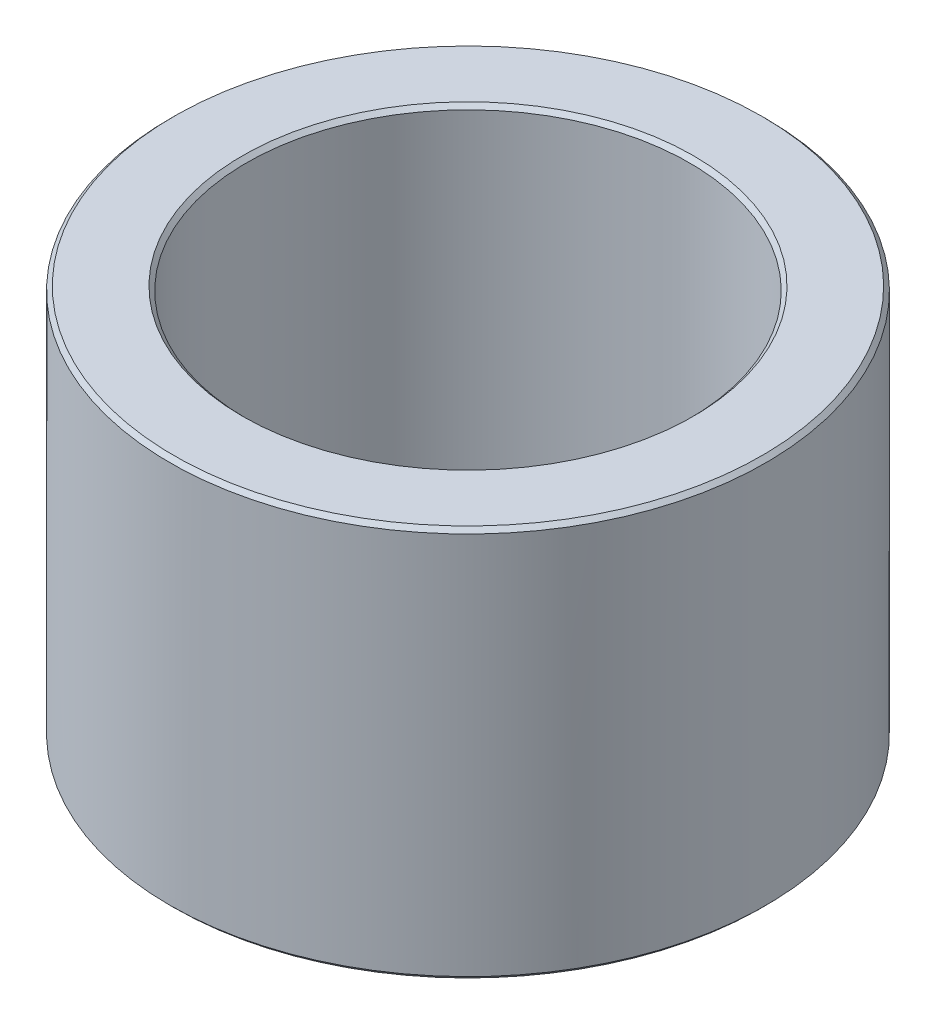
ISO-10303-21;
HEADER;
FILE_DESCRIPTION(('STEP AP214'),'2;1');
FILE_NAME('part.step','',(''),(''),'','','');
FILE_SCHEMA(('AUTOMOTIVE_DESIGN { 1 0 10303 214 1 1 1 1 }'));
ENDSEC;
DATA;
#1=APPLICATION_CONTEXT('core data for automotive mechanical design processes');
#2=APPLICATION_PROTOCOL_DEFINITION('international standard','automotive_design',2000,#1);
#3=PRODUCT_CONTEXT('',#1,'mechanical');
#4=PRODUCT('Part','Part','',(#3));
#5=PRODUCT_RELATED_PRODUCT_CATEGORY('part','',(#4));
#6=PRODUCT_DEFINITION_FORMATION('','',#4);
#7=PRODUCT_DEFINITION_CONTEXT('part definition',#1,'design');
#8=PRODUCT_DEFINITION('design','',#6,#7);
#9=PRODUCT_DEFINITION_SHAPE('','',#8);
#10=(LENGTH_UNIT() NAMED_UNIT(*) SI_UNIT(.MILLI.,.METRE.));
#11=(NAMED_UNIT(*) PLANE_ANGLE_UNIT() SI_UNIT($,.RADIAN.));
#12=(NAMED_UNIT(*) SI_UNIT($,.STERADIAN.) SOLID_ANGLE_UNIT());
#13=UNCERTAINTY_MEASURE_WITH_UNIT(LENGTH_MEASURE(1.E-05),#10,'distance_accuracy_value','');
#14=(GEOMETRIC_REPRESENTATION_CONTEXT(3) GLOBAL_UNCERTAINTY_ASSIGNED_CONTEXT((#13)) GLOBAL_UNIT_ASSIGNED_CONTEXT((#10,
#11,#12)) REPRESENTATION_CONTEXT('',''));
#15=CARTESIAN_POINT('',(0.,0.,0.));
#16=DIRECTION('',(0.,0.,1.));
#17=DIRECTION('',(1.,0.,0.));
#18=AXIS2_PLACEMENT_3D('',#15,#16,#17);
#19=CARTESIAN_POINT('',(0.,39.4084864140613,0.));
#20=DIRECTION('',(0.,-1.,0.));
#21=DIRECTION('',(0.,0.,-1.));
#22=AXIS2_PLACEMENT_3D('',#19,#20,#21);
#23=CYLINDRICAL_SURFACE('',#22,30.);
#24=CARTESIAN_POINT('',(0.,0.410876331803603,0.));
#25=DIRECTION('',(0.,1.,0.));
#26=DIRECTION('',(0.,0.,1.));
#27=AXIS2_PLACEMENT_3D('',#24,#25,#26);
#28=CIRCLE('',#27,30.);
#29=CARTESIAN_POINT('',(0.,0.410876331803603,30.));
#30=VERTEX_POINT('',#29);
#31=EDGE_CURVE('E10',#30,#30,#28,.T.);
#32=ORIENTED_EDGE('',*,*,#31,.T.);
#33=EDGE_LOOP('',(#32));
#34=FACE_BOUND('',#33,.T.);
#35=CARTESIAN_POINT('',(0.,38.9976100822577,0.));
#36=DIRECTION('',(0.,1.,0.));
#37=DIRECTION('',(0.,0.,1.));
#38=AXIS2_PLACEMENT_3D('',#35,#36,#37);
#39=CIRCLE('',#38,30.);
#40=CARTESIAN_POINT('',(0.,38.9976100822577,-30.));
#41=VERTEX_POINT('',#40);
#42=EDGE_CURVE('E50',#41,#41,#39,.F.);
#43=ORIENTED_EDGE('',*,*,#42,.T.);
#44=EDGE_LOOP('',(#43));
#45=FACE_BOUND('',#44,.T.);
#46=ADVANCED_FACE('F39',(#34,#45),#23,.T.);
#47=CARTESIAN_POINT('',(0.,39.4084864140613,0.));
#48=DIRECTION('',(0.,1.,0.));
#49=DIRECTION('',(0.,0.,1.));
#50=AXIS2_PLACEMENT_3D('',#47,#48,#49);
#51=PLANE('',#50);
#52=CARTESIAN_POINT('',(0.,39.4084864140613,0.));
#53=DIRECTION('',(0.,1.,0.));
#54=DIRECTION('',(0.,0.,1.));
#55=AXIS2_PLACEMENT_3D('',#52,#53,#54);
#56=CIRCLE('',#55,22.711703945499);
#57=CARTESIAN_POINT('',(0.,39.4084864140613,22.711703945499));
#58=VERTEX_POINT('',#57);
#59=EDGE_CURVE('E58',#58,#58,#56,.F.);
#60=ORIENTED_EDGE('',*,*,#59,.T.);
#61=EDGE_LOOP('',(#60));
#62=FACE_BOUND('',#61,.T.);
#63=CARTESIAN_POINT('',(0.,39.4084864140613,0.));
#64=DIRECTION('',(0.,1.,0.));
#65=DIRECTION('',(0.,0.,1.));
#66=AXIS2_PLACEMENT_3D('',#63,#64,#65);
#67=CIRCLE('',#66,29.5891236681964);
#68=CARTESIAN_POINT('',(0.,39.4084864140613,-29.5891236681964));
#69=VERTEX_POINT('',#68);
#70=EDGE_CURVE('E61',#69,#69,#67,.T.);
#71=ORIENTED_EDGE('',*,*,#70,.T.);
#72=EDGE_LOOP('',(#71));
#73=FACE_BOUND('',#72,.T.);
#74=ADVANCED_FACE('F88',(#62,#73),#51,.T.);
#75=CARTESIAN_POINT('',(0.,0.,0.));
#76=DIRECTION('',(0.,1.,0.));
#77=DIRECTION('',(0.,0.,1.));
#78=AXIS2_PLACEMENT_3D('',#75,#76,#77);
#79=PLANE('',#78);
#80=CARTESIAN_POINT('',(0.,0.,0.));
#81=DIRECTION('',(0.,1.,0.));
#82=DIRECTION('',(0.,0.,1.));
#83=AXIS2_PLACEMENT_3D('',#80,#81,#82);
#84=CIRCLE('',#83,22.7117039454991);
#85=CARTESIAN_POINT('',(0.,0.,22.7117039454991));
#86=VERTEX_POINT('',#85);
#87=EDGE_CURVE('E51',#86,#86,#84,.T.);
#88=ORIENTED_EDGE('',*,*,#87,.T.);
#89=EDGE_LOOP('',(#88));
#90=FACE_BOUND('',#89,.T.);
#91=CARTESIAN_POINT('',(0.,0.,0.));
#92=DIRECTION('',(0.,1.,0.));
#93=DIRECTION('',(0.,0.,1.));
#94=AXIS2_PLACEMENT_3D('',#91,#92,#93);
#95=CIRCLE('',#94,29.5891236681964);
#96=CARTESIAN_POINT('',(0.,0.,29.5891236681964));
#97=VERTEX_POINT('',#96);
#98=EDGE_CURVE('E54',#97,#97,#95,.F.);
#99=ORIENTED_EDGE('',*,*,#98,.T.);
#100=EDGE_LOOP('',(#99));
#101=FACE_BOUND('',#100,.T.);
#102=ADVANCED_FACE('F83',(#90,#101),#79,.F.);
#103=CARTESIAN_POINT('',(0.,39.4084864140613,0.));
#104=DIRECTION('',(0.,-1.,0.));
#105=DIRECTION('',(0.,0.,-1.));
#106=AXIS2_PLACEMENT_3D('',#103,#104,#105);
#107=CYLINDRICAL_SURFACE('',#106,22.3008276136954);
#108=CARTESIAN_POINT('',(0.,38.9976100822578,0.));
#109=DIRECTION('',(0.,1.,0.));
#110=DIRECTION('',(0.,0.,1.));
#111=AXIS2_PLACEMENT_3D('',#108,#109,#110);
#112=CIRCLE('',#111,22.3008276136954);
#113=CARTESIAN_POINT('',(0.,38.9976100822578,22.3008276136954));
#114=VERTEX_POINT('',#113);
#115=EDGE_CURVE('E67',#114,#114,#112,.T.);
#116=ORIENTED_EDGE('',*,*,#115,.T.);
#117=EDGE_LOOP('',(#116));
#118=FACE_BOUND('',#117,.T.);
#119=CARTESIAN_POINT('',(0.,0.41087633180361,0.));
#120=DIRECTION('',(0.,1.,0.));
#121=DIRECTION('',(0.,0.,1.));
#122=AXIS2_PLACEMENT_3D('',#119,#120,#121);
#123=CIRCLE('',#122,22.3008276136954);
#124=CARTESIAN_POINT('',(0.,0.41087633180361,22.3008276136954));
#125=VERTEX_POINT('',#124);
#126=EDGE_CURVE('E69',#125,#125,#123,.F.);
#127=ORIENTED_EDGE('',*,*,#126,.T.);
#128=EDGE_LOOP('',(#127));
#129=FACE_BOUND('',#128,.T.);
#130=ADVANCED_FACE('F71',(#118,#129),#107,.F.);
#131=CARTESIAN_POINT('',(0.,38.9976100822578,0.));
#132=DIRECTION('',(0.,1.,0.));
#133=DIRECTION('',(0.,0.,1.));
#134=AXIS2_PLACEMENT_3D('',#131,#132,#133);
#135=CONICAL_SURFACE('',#134,22.3008276136954,0.785398163397448);
#136=ORIENTED_EDGE('',*,*,#59,.F.);
#137=EDGE_LOOP('',(#136));
#138=FACE_BOUND('',#137,.T.);
#139=ORIENTED_EDGE('',*,*,#115,.F.);
#140=EDGE_LOOP('',(#139));
#141=FACE_BOUND('',#140,.T.);
#142=ADVANCED_FACE('F77',(#138,#141),#135,.F.);
#143=CARTESIAN_POINT('',(0.,0.,0.));
#144=DIRECTION('',(0.,-1.,0.));
#145=DIRECTION('',(0.,0.,-1.));
#146=AXIS2_PLACEMENT_3D('',#143,#144,#145);
#147=CONICAL_SURFACE('',#146,22.7117039454991,0.785398163397448);
#148=ORIENTED_EDGE('',*,*,#126,.F.);
#149=EDGE_LOOP('',(#148));
#150=FACE_BOUND('',#149,.T.);
#151=ORIENTED_EDGE('',*,*,#87,.F.);
#152=EDGE_LOOP('',(#151));
#153=FACE_BOUND('',#152,.T.);
#154=ADVANCED_FACE('F73',(#150,#153),#147,.F.);
#155=CARTESIAN_POINT('',(0.,0.410876331803603,0.));
#156=DIRECTION('',(0.,1.,0.));
#157=DIRECTION('',(0.,0.,1.));
#158=AXIS2_PLACEMENT_3D('',#155,#156,#157);
#159=CONICAL_SURFACE('',#158,30.,0.785398163397448);
#160=ORIENTED_EDGE('',*,*,#98,.F.);
#161=EDGE_LOOP('',(#160));
#162=FACE_BOUND('',#161,.T.);
#163=ORIENTED_EDGE('',*,*,#31,.F.);
#164=EDGE_LOOP('',(#163));
#165=FACE_BOUND('',#164,.T.);
#166=ADVANCED_FACE('F76',(#162,#165),#159,.T.);
#167=CARTESIAN_POINT('',(0.,39.4084864140613,0.));
#168=DIRECTION('',(0.,-1.,0.));
#169=DIRECTION('',(0.,0.,-1.));
#170=AXIS2_PLACEMENT_3D('',#167,#168,#169);
#171=CONICAL_SURFACE('',#170,29.5891236681964,0.785398163397448);
#172=CARTESIAN_POINT('',(0.,38.9976100822577,-30.));
#173=CARTESIAN_POINT('',(0.,39.0018900440473,-29.9957200382104));
#174=CARTESIAN_POINT('',(0.,39.006170005837,-29.9914400764208));
#175=CARTESIAN_POINT('',(0.,39.0147299294162,-29.9828801528415));
#176=CARTESIAN_POINT('',(0.,39.0190098912058,-29.9786001910519));
#177=CARTESIAN_POINT('',(0.,39.0275698147851,-29.9700402674727));
#178=CARTESIAN_POINT('',(0.,39.0318497765747,-29.965760305683));
#179=CARTESIAN_POINT('',(0.,39.0404097001539,-29.9572003821038));
#180=CARTESIAN_POINT('',(0.,39.0446896619436,-29.9529204203142));
#181=CARTESIAN_POINT('',(0.,39.0532495855228,-29.9443604967349));
#182=CARTESIAN_POINT('',(0.,39.0575295473124,-29.9400805349453));
#183=CARTESIAN_POINT('',(0.,39.0660894708917,-29.9315206113661));
#184=CARTESIAN_POINT('',(0.,39.0703694326813,-29.9272406495764));
#185=CARTESIAN_POINT('',(0.,39.0789293562605,-29.9186807259972));
#186=CARTESIAN_POINT('',(0.,39.0832093180501,-29.9144007642076));
#187=CARTESIAN_POINT('',(0.,39.0917692416294,-29.9058408406283));
#188=CARTESIAN_POINT('',(0.,39.096049203419,-29.9015608788387));
#189=CARTESIAN_POINT('',(0.,39.1046091269982,-29.8930009552595));
#190=CARTESIAN_POINT('',(0.,39.1088890887879,-29.8887209934699));
#191=CARTESIAN_POINT('',(0.,39.1174490123671,-29.8801610698906));
#192=CARTESIAN_POINT('',(0.,39.1217289741567,-29.875881108101));
#193=CARTESIAN_POINT('',(0.,39.130288897736,-29.8673211845217));
#194=CARTESIAN_POINT('',(0.,39.1345688595256,-29.8630412227321));
#195=CARTESIAN_POINT('',(0.,39.1431287831048,-29.8544812991529));
#196=CARTESIAN_POINT('',(0.,39.1474087448945,-29.8502013373633));
#197=CARTESIAN_POINT('',(0.,39.1559686684737,-29.841641413784));
#198=CARTESIAN_POINT('',(0.,39.1602486302633,-29.8373614519944));
#199=CARTESIAN_POINT('',(0.,39.1688085538426,-29.8288015284152));
#200=CARTESIAN_POINT('',(0.,39.1730885156322,-29.8245215666255));
#201=CARTESIAN_POINT('',(0.,39.1816484392114,-29.8159616430463));
#202=CARTESIAN_POINT('',(0.,39.185928401001,-29.8116816812567));
#203=CARTESIAN_POINT('',(0.,39.1944883245803,-29.8031217576774));
#204=CARTESIAN_POINT('',(0.,39.1987682863699,-29.7988417958878));
#205=CARTESIAN_POINT('',(0.,39.2073282099492,-29.7902818723086));
#206=CARTESIAN_POINT('',(0.,39.2116081717388,-29.786001910519));
#207=CARTESIAN_POINT('',(0.,39.220168095318,-29.7774419869397));
#208=CARTESIAN_POINT('',(0.,39.2244480571076,-29.7731620251501));
#209=CARTESIAN_POINT('',(0.,39.2330079806869,-29.7646021015708));
#210=CARTESIAN_POINT('',(0.,39.2372879424765,-29.7603221397812));
#211=CARTESIAN_POINT('',(0.,39.2458478660557,-29.751762216202));
#212=CARTESIAN_POINT('',(0.,39.2501278278454,-29.7474822544124));
#213=CARTESIAN_POINT('',(0.,39.2586877514246,-29.7389223308331));
#214=CARTESIAN_POINT('',(0.,39.2629677132142,-29.7346423690435));
#215=CARTESIAN_POINT('',(0.,39.2715276367935,-29.7260824454643));
#216=CARTESIAN_POINT('',(0.,39.2758075985831,-29.7218024836746));
#217=CARTESIAN_POINT('',(0.,39.2843675221623,-29.7132425600954));
#218=CARTESIAN_POINT('',(0.,39.2886474839519,-29.7089625983058));
#219=CARTESIAN_POINT('',(0.,39.2972074075312,-29.7004026747265));
#220=CARTESIAN_POINT('',(0.,39.3014873693208,-29.6961227129369));
#221=CARTESIAN_POINT('',(0.,39.3100472929001,-29.6875627893577));
#222=CARTESIAN_POINT('',(0.,39.3143272546897,-29.683282827568));
#223=CARTESIAN_POINT('',(0.,39.3228871782689,-29.6747229039888));
#224=CARTESIAN_POINT('',(0.,39.3271671400585,-29.6704429421992));
#225=CARTESIAN_POINT('',(0.,39.3357270636378,-29.6618830186199));
#226=CARTESIAN_POINT('',(0.,39.3400070254274,-29.6576030568303));
#227=CARTESIAN_POINT('',(0.,39.3485669490066,-29.6490431332511));
#228=CARTESIAN_POINT('',(0.,39.3528469107963,-29.6447631714615));
#229=CARTESIAN_POINT('',(0.,39.3614068343755,-29.6362032478822));
#230=CARTESIAN_POINT('',(0.,39.3656867961651,-29.6319232860926));
#231=CARTESIAN_POINT('',(0.,39.3742467197444,-29.6233633625134));
#232=CARTESIAN_POINT('',(0.,39.378526681534,-29.6190834007237));
#233=CARTESIAN_POINT('',(0.,39.3870866051132,-29.6105234771445));
#234=CARTESIAN_POINT('',(0.,39.3913665669028,-29.6062435153549));
#235=CARTESIAN_POINT('',(0.,39.3999264904821,-29.5976835917756));
#236=CARTESIAN_POINT('',(0.,39.4042064522717,-29.593403629986));
#237=CARTESIAN_POINT('',(0.,39.4084864140613,-29.5891236681964));
#238=B_SPLINE_CURVE_WITH_KNOTS('',3,(#172,#173,#174,#175,#176,#177,#178,#179,#180,#181,#182,
#183,#184,#185,#186,#187,#188,#189,#190,#191,#192,#193,#194,#195,#196,#197,#198,#199,#200,#201,
#202,#203,#204,#205,#206,#207,#208,#209,#210,#211,#212,#213,#214,#215,#216,#217,#218,#219,#220,
#221,#222,#223,#224,#225,#226,#227,#228,#229,#230,#231,#232,#233,#234,#235,#236,#237),
.UNSPECIFIED.,.F.,.F.,(4,2,2,2,2,2,2,2,2,2,2,2,2,2,2,2,2,2,2,2,2,2,2,2,2,2,2,2,2,2,2,2,4),(0.,
0.0181583400279607,0.0363166800559239,0.0544750200838847,0.0726333601118454,0.0907917001398061,
0.108950040167767,0.12710838019573,0.145266720223696,0.163425060251656,0.18158340027962,
0.19974174030758,0.217900080335541,0.236058420363502,0.254216760391463,0.272375100419426,
0.290533440447391,0.308691780475352,0.326850120503315,0.345008460531276,0.363166800559237,
0.381325140587198,0.399483480615158,0.417641820643122,0.435800160671087,0.453958500699048,
0.472116840727011,0.490275180754972,0.508433520782933,0.526591860810893,0.544750200838854,
0.562908540866817,0.581066880894783),.UNSPECIFIED.);
#239=EDGE_CURVE('BSEAM45',#41,#69,#238,.T.);
#240=ORIENTED_EDGE('',*,*,#42,.F.);
#241=ORIENTED_EDGE('',*,*,#70,.F.);
#242=ORIENTED_EDGE('',*,*,#239,.T.);
#243=ORIENTED_EDGE('',*,*,#239,.F.);
#244=EDGE_LOOP('',(#240,#242,#241,#243));
#245=FACE_BOUND('',#244,.T.);
#246=ADVANCED_FACE('F45',(#245),#171,.T.);
#247=CLOSED_SHELL('',(#46,#74,#102,#130,#142,#154,#166,#246));
#248=MANIFOLD_SOLID_BREP('B2',#247);
#249=ADVANCED_BREP_SHAPE_REPRESENTATION('',(#18,#248),#14);
#250=SHAPE_DEFINITION_REPRESENTATION(#9,#249);
ENDSEC;
END-ISO-10303-21;
